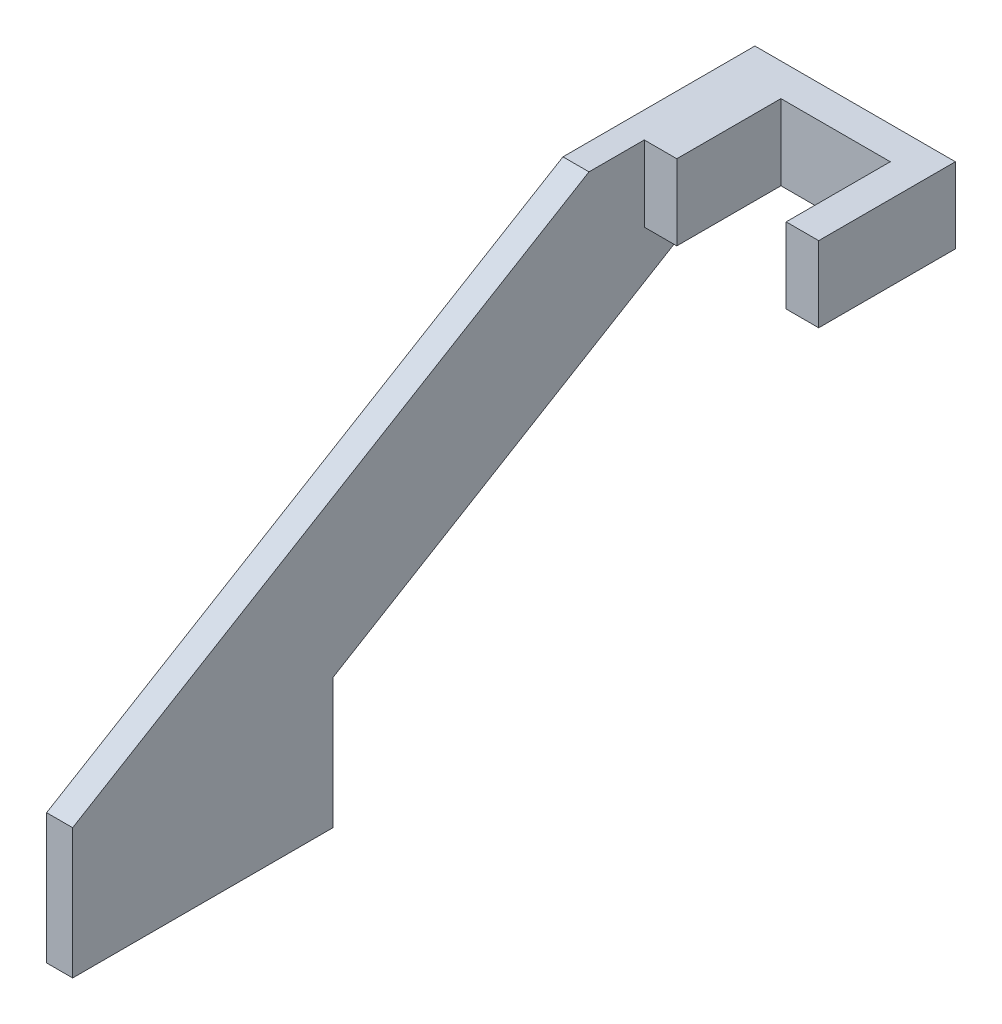
ISO-10303-21;
HEADER;
FILE_DESCRIPTION(('STEP AP214'),'2;1');
FILE_NAME('part.step','',(''),(''),'','','');
FILE_SCHEMA(('AUTOMOTIVE_DESIGN { 1 0 10303 214 1 1 1 1 }'));
ENDSEC;
DATA;
#1=APPLICATION_CONTEXT('core data for automotive mechanical design processes');
#2=APPLICATION_PROTOCOL_DEFINITION('international standard','automotive_design',2000,#1);
#3=PRODUCT_CONTEXT('',#1,'mechanical');
#4=PRODUCT('Part','Part','',(#3));
#5=PRODUCT_RELATED_PRODUCT_CATEGORY('part','',(#4));
#6=PRODUCT_DEFINITION_FORMATION('','',#4);
#7=PRODUCT_DEFINITION_CONTEXT('part definition',#1,'design');
#8=PRODUCT_DEFINITION('design','',#6,#7);
#9=PRODUCT_DEFINITION_SHAPE('','',#8);
#10=(LENGTH_UNIT() NAMED_UNIT(*) SI_UNIT(.MILLI.,.METRE.));
#11=(NAMED_UNIT(*) PLANE_ANGLE_UNIT() SI_UNIT($,.RADIAN.));
#12=(NAMED_UNIT(*) SI_UNIT($,.STERADIAN.) SOLID_ANGLE_UNIT());
#13=UNCERTAINTY_MEASURE_WITH_UNIT(LENGTH_MEASURE(1.E-05),#10,'distance_accuracy_value','');
#14=(GEOMETRIC_REPRESENTATION_CONTEXT(3) GLOBAL_UNCERTAINTY_ASSIGNED_CONTEXT((#13)) GLOBAL_UNIT_ASSIGNED_CONTEXT((#10,
#11,#12)) REPRESENTATION_CONTEXT('',''));
#15=CARTESIAN_POINT('',(0.,0.,0.));
#16=DIRECTION('',(0.,0.,1.));
#17=DIRECTION('',(1.,0.,0.));
#18=AXIS2_PLACEMENT_3D('',#15,#16,#17);
#19=CARTESIAN_POINT('',(2.54,0.,0.));
#20=DIRECTION('',(1.,0.,0.));
#21=DIRECTION('',(0.,0.,-1.));
#22=AXIS2_PLACEMENT_3D('',#19,#20,#21);
#23=PLANE('',#22);
#24=DIRECTION('',(0.,0.514495755427526,-0.857492925712544));
#25=VECTOR('',#24,1.);
#26=CARTESIAN_POINT('',(2.54,-17.237142577649,21.989657734469));
#27=LINE('',#26,#25);
#28=CARTESIAN_POINT('',(2.54,-17.237142577649,21.989657734469));
#29=VERTEX_POINT('',#28);
#30=CARTESIAN_POINT('',(2.54,5.62285742235095,-16.1103422655311));
#31=VERTEX_POINT('',#30);
#32=EDGE_CURVE('E229',#29,#31,#27,.T.);
#33=ORIENTED_EDGE('',*,*,#32,.T.);
#34=DIRECTION('',(0.,0.,1.));
#35=VECTOR('',#34,1.);
#36=CARTESIAN_POINT('',(2.54,5.62285742235095,0.));
#37=LINE('',#36,#35);
#38=CARTESIAN_POINT('',(2.54,5.62285742235095,-8.37978701278809));
#39=VERTEX_POINT('',#38);
#40=EDGE_CURVE('E11',#31,#39,#37,.T.);
#41=ORIENTED_EDGE('',*,*,#40,.T.);
#42=DIRECTION('',(0.,1.,0.));
#43=VECTOR('',#42,1.);
#44=CARTESIAN_POINT('',(2.54,0.,-8.37978701278809));
#45=LINE('',#44,#43);
#46=CARTESIAN_POINT('',(2.54,12.9888574223509,-8.37978701278809));
#47=VERTEX_POINT('',#46);
#48=EDGE_CURVE('E201',#39,#47,#45,.T.);
#49=ORIENTED_EDGE('',*,*,#48,.T.);
#50=DIRECTION('',(0.,0.,1.));
#51=VECTOR('',#50,1.);
#52=CARTESIAN_POINT('',(2.54,12.9888574223509,-21.7147870127881));
#53=LINE('',#52,#51);
#54=CARTESIAN_POINT('',(2.54,12.9888574223509,-2.98700893219766));
#55=VERTEX_POINT('',#54);
#56=EDGE_CURVE('E234',#47,#55,#53,.T.);
#57=ORIENTED_EDGE('',*,*,#56,.T.);
#58=DIRECTION('',(0.,-0.514495755427527,0.857492925712544));
#59=VECTOR('',#58,1.);
#60=CARTESIAN_POINT('',(2.54,12.9888574223509,-2.98700893219766));
#61=LINE('',#60,#59);
#62=CARTESIAN_POINT('',(2.54,-17.237142577649,47.389657734469));
#63=VERTEX_POINT('',#62);
#64=EDGE_CURVE('E232',#55,#63,#61,.T.);
#65=ORIENTED_EDGE('',*,*,#64,.T.);
#66=DIRECTION('',(0.,-1.,0.));
#67=VECTOR('',#66,1.);
#68=CARTESIAN_POINT('',(2.54,-17.237142577649,47.389657734469));
#69=LINE('',#68,#67);
#70=CARTESIAN_POINT('',(2.54,-29.937142577649,47.389657734469));
#71=VERTEX_POINT('',#70);
#72=EDGE_CURVE('E221',#63,#71,#69,.T.);
#73=ORIENTED_EDGE('',*,*,#72,.T.);
#74=DIRECTION('',(0.,0.,-1.));
#75=VECTOR('',#74,1.);
#76=CARTESIAN_POINT('',(2.54,-29.937142577649,47.389657734469));
#77=LINE('',#76,#75);
#78=CARTESIAN_POINT('',(2.54,-29.937142577649,21.989657734469));
#79=VERTEX_POINT('',#78);
#80=EDGE_CURVE('E224',#71,#79,#77,.T.);
#81=ORIENTED_EDGE('',*,*,#80,.T.);
#82=DIRECTION('',(0.,1.,0.));
#83=VECTOR('',#82,1.);
#84=CARTESIAN_POINT('',(2.54,-29.937142577649,21.989657734469));
#85=LINE('',#84,#83);
#86=EDGE_CURVE('E227',#79,#29,#85,.T.);
#87=ORIENTED_EDGE('',*,*,#86,.T.);
#88=EDGE_LOOP('',(#33,#41,#49,#57,#65,#73,#81,#87));
#89=FACE_BOUND('',#88,.T.);
#90=ADVANCED_FACE('F35',(#89),#23,.T.);
#91=CARTESIAN_POINT('',(2.54,-17.237142577649,47.389657734469));
#92=DIRECTION('',(0.,0.,-1.));
#93=DIRECTION('',(-1.,0.,0.));
#94=AXIS2_PLACEMENT_3D('',#91,#92,#93);
#95=PLANE('',#94);
#96=DIRECTION('',(0.,-1.,0.));
#97=VECTOR('',#96,1.);
#98=CARTESIAN_POINT('',(0.,-17.237142577649,47.389657734469));
#99=LINE('',#98,#97);
#100=CARTESIAN_POINT('',(0.,-17.237142577649,47.389657734469));
#101=VERTEX_POINT('',#100);
#102=CARTESIAN_POINT('',(0.,-29.937142577649,47.389657734469));
#103=VERTEX_POINT('',#102);
#104=EDGE_CURVE('E262',#101,#103,#99,.T.);
#105=ORIENTED_EDGE('',*,*,#104,.T.);
#106=DIRECTION('',(-1.,0.,0.));
#107=VECTOR('',#106,1.);
#108=CARTESIAN_POINT('',(2.54,-29.937142577649,47.389657734469));
#109=LINE('',#108,#107);
#110=EDGE_CURVE('E45',#71,#103,#109,.T.);
#111=ORIENTED_EDGE('',*,*,#110,.F.);
#112=ORIENTED_EDGE('',*,*,#72,.F.);
#113=DIRECTION('',(-1.,0.,0.));
#114=VECTOR('',#113,1.);
#115=CARTESIAN_POINT('',(2.54,-17.237142577649,47.389657734469));
#116=LINE('',#115,#114);
#117=EDGE_CURVE('E248',#63,#101,#116,.T.);
#118=ORIENTED_EDGE('',*,*,#117,.T.);
#119=EDGE_LOOP('',(#105,#111,#112,#118));
#120=FACE_BOUND('',#119,.T.);
#121=ADVANCED_FACE('F37',(#120),#95,.F.);
#122=CARTESIAN_POINT('',(2.54,-29.937142577649,47.389657734469));
#123=DIRECTION('',(0.,1.,0.));
#124=DIRECTION('',(0.,0.,1.));
#125=AXIS2_PLACEMENT_3D('',#122,#123,#124);
#126=PLANE('',#125);
#127=DIRECTION('',(0.,0.,-1.));
#128=VECTOR('',#127,1.);
#129=CARTESIAN_POINT('',(0.,-29.937142577649,47.389657734469));
#130=LINE('',#129,#128);
#131=CARTESIAN_POINT('',(0.,-29.937142577649,21.989657734469));
#132=VERTEX_POINT('',#131);
#133=EDGE_CURVE('E261',#103,#132,#130,.T.);
#134=ORIENTED_EDGE('',*,*,#133,.T.);
#135=DIRECTION('',(-1.,0.,0.));
#136=VECTOR('',#135,1.);
#137=CARTESIAN_POINT('',(2.54,-29.937142577649,21.989657734469));
#138=LINE('',#137,#136);
#139=EDGE_CURVE('E238',#79,#132,#138,.T.);
#140=ORIENTED_EDGE('',*,*,#139,.F.);
#141=ORIENTED_EDGE('',*,*,#80,.F.);
#142=ORIENTED_EDGE('',*,*,#110,.T.);
#143=EDGE_LOOP('',(#134,#140,#141,#142));
#144=FACE_BOUND('',#143,.T.);
#145=ADVANCED_FACE('F276',(#144),#126,.F.);
#146=CARTESIAN_POINT('',(2.54,-29.937142577649,21.989657734469));
#147=DIRECTION('',(0.,0.,1.));
#148=DIRECTION('',(1.,0.,0.));
#149=AXIS2_PLACEMENT_3D('',#146,#147,#148);
#150=PLANE('',#149);
#151=DIRECTION('',(0.,1.,0.));
#152=VECTOR('',#151,1.);
#153=CARTESIAN_POINT('',(0.,-29.937142577649,21.989657734469));
#154=LINE('',#153,#152);
#155=CARTESIAN_POINT('',(0.,-17.237142577649,21.989657734469));
#156=VERTEX_POINT('',#155);
#157=EDGE_CURVE('E259',#132,#156,#154,.T.);
#158=ORIENTED_EDGE('',*,*,#157,.T.);
#159=DIRECTION('',(-1.,0.,0.));
#160=VECTOR('',#159,1.);
#161=CARTESIAN_POINT('',(2.54,-17.237142577649,21.989657734469));
#162=LINE('',#161,#160);
#163=EDGE_CURVE('E241',#29,#156,#162,.T.);
#164=ORIENTED_EDGE('',*,*,#163,.F.);
#165=ORIENTED_EDGE('',*,*,#86,.F.);
#166=ORIENTED_EDGE('',*,*,#139,.T.);
#167=EDGE_LOOP('',(#158,#164,#165,#166));
#168=FACE_BOUND('',#167,.T.);
#169=ADVANCED_FACE('F300',(#168),#150,.F.);
#170=CARTESIAN_POINT('',(2.54,-17.237142577649,21.989657734469));
#171=DIRECTION('',(0.,0.857492925712544,0.514495755427526));
#172=DIRECTION('',(0.,-0.514495755427526,0.857492925712544));
#173=AXIS2_PLACEMENT_3D('',#170,#171,#172);
#174=PLANE('',#173);
#175=DIRECTION('',(0.,0.514495755427526,-0.857492925712544));
#176=VECTOR('',#175,1.);
#177=CARTESIAN_POINT('',(0.,-17.237142577649,21.989657734469));
#178=LINE('',#177,#176);
#179=CARTESIAN_POINT('',(0.,5.62285742235095,-16.110342265531));
#180=VERTEX_POINT('',#179);
#181=EDGE_CURVE('E257',#156,#180,#178,.T.);
#182=ORIENTED_EDGE('',*,*,#181,.T.);
#183=DIRECTION('',(-1.,0.,0.));
#184=VECTOR('',#183,1.);
#185=CARTESIAN_POINT('',(2.54,5.62285742235095,-16.110342265531));
#186=LINE('',#185,#184);
#187=EDGE_CURVE('E244',#31,#180,#186,.T.);
#188=ORIENTED_EDGE('',*,*,#187,.F.);
#189=ORIENTED_EDGE('',*,*,#32,.F.);
#190=ORIENTED_EDGE('',*,*,#163,.T.);
#191=EDGE_LOOP('',(#182,#188,#189,#190));
#192=FACE_BOUND('',#191,.T.);
#193=ADVANCED_FACE('F298',(#192),#174,.F.);
#194=CARTESIAN_POINT('',(2.54,5.62285742235095,-16.110342265531));
#195=DIRECTION('',(0.,1.,0.));
#196=DIRECTION('',(0.,0.,1.));
#197=AXIS2_PLACEMENT_3D('',#194,#195,#196);
#198=PLANE('',#197);
#199=DIRECTION('',(0.,0.,-1.));
#200=VECTOR('',#199,1.);
#201=CARTESIAN_POINT('',(0.,5.62285742235095,-16.110342265531));
#202=LINE('',#201,#200);
#203=CARTESIAN_POINT('',(0.,5.62285742235095,-21.7147870127881));
#204=VERTEX_POINT('',#203);
#205=EDGE_CURVE('E255',#180,#204,#202,.T.);
#206=ORIENTED_EDGE('',*,*,#205,.T.);
#207=DIRECTION('',(-1.,0.,0.));
#208=VECTOR('',#207,1.);
#209=CARTESIAN_POINT('',(2.54,5.62285742235095,-21.7147870127881));
#210=LINE('',#209,#208);
#211=CARTESIAN_POINT('',(19.558,5.62285742235095,-21.7147870127881));
#212=VERTEX_POINT('',#211);
#213=EDGE_CURVE('E151',#212,#204,#210,.T.);
#214=ORIENTED_EDGE('',*,*,#213,.F.);
#215=DIRECTION('',(0.,0.,-1.));
#216=VECTOR('',#215,1.);
#217=CARTESIAN_POINT('',(19.558,5.62285742235095,-21.7147870127881));
#218=LINE('',#217,#216);
#219=CARTESIAN_POINT('',(19.558,5.62285742235095,-8.37978701278808));
#220=VERTEX_POINT('',#219);
#221=EDGE_CURVE('E166',#220,#212,#218,.T.);
#222=ORIENTED_EDGE('',*,*,#221,.F.);
#223=DIRECTION('',(-1.,0.,0.));
#224=VECTOR('',#223,1.);
#225=CARTESIAN_POINT('',(19.558,5.62285742235095,-8.37978701278808));
#226=LINE('',#225,#224);
#227=CARTESIAN_POINT('',(16.383,5.62285742235095,-8.37978701278808));
#228=VERTEX_POINT('',#227);
#229=EDGE_CURVE('E175',#220,#228,#226,.T.);
#230=ORIENTED_EDGE('',*,*,#229,.T.);
#231=DIRECTION('',(0.,0.,-1.));
#232=VECTOR('',#231,1.);
#233=CARTESIAN_POINT('',(16.383,5.62285742235095,-21.7147870127881));
#234=LINE('',#233,#232);
#235=CARTESIAN_POINT('',(16.383,5.62285742235095,-18.5397870127881));
#236=VERTEX_POINT('',#235);
#237=EDGE_CURVE('E167',#228,#236,#234,.T.);
#238=ORIENTED_EDGE('',*,*,#237,.T.);
#239=DIRECTION('',(-1.,0.,0.));
#240=VECTOR('',#239,1.);
#241=CARTESIAN_POINT('',(16.383,5.62285742235095,-18.5397870127881));
#242=LINE('',#241,#240);
#243=CARTESIAN_POINT('',(5.715,5.62285742235095,-18.5397870127881));
#244=VERTEX_POINT('',#243);
#245=EDGE_CURVE('E194',#236,#244,#242,.T.);
#246=ORIENTED_EDGE('',*,*,#245,.T.);
#247=DIRECTION('',(0.,0.,1.));
#248=VECTOR('',#247,1.);
#249=CARTESIAN_POINT('',(5.715,5.62285742235095,0.));
#250=LINE('',#249,#248);
#251=CARTESIAN_POINT('',(5.715,5.62285742235095,-8.37978701278809));
#252=VERTEX_POINT('',#251);
#253=EDGE_CURVE('E191',#244,#252,#250,.T.);
#254=ORIENTED_EDGE('',*,*,#253,.T.);
#255=DIRECTION('',(-1.,0.,0.));
#256=VECTOR('',#255,1.);
#257=CARTESIAN_POINT('',(5.715,5.62285742235095,-8.37978701278809));
#258=LINE('',#257,#256);
#259=EDGE_CURVE('E219',#252,#39,#258,.T.);
#260=ORIENTED_EDGE('',*,*,#259,.T.);
#261=ORIENTED_EDGE('',*,*,#40,.F.);
#262=ORIENTED_EDGE('',*,*,#187,.T.);
#263=EDGE_LOOP('',(#206,#214,#222,#230,#238,#246,#254,#260,#261,#262));
#264=FACE_BOUND('',#263,.T.);
#265=ADVANCED_FACE('F286',(#264),#198,.F.);
#266=CARTESIAN_POINT('',(2.54,5.62285742235095,-21.7147870127881));
#267=DIRECTION('',(0.,0.,1.));
#268=DIRECTION('',(1.,0.,0.));
#269=AXIS2_PLACEMENT_3D('',#266,#267,#268);
#270=PLANE('',#269);
#271=DIRECTION('',(0.,1.,0.));
#272=VECTOR('',#271,1.);
#273=CARTESIAN_POINT('',(0.,5.62285742235095,-21.7147870127881));
#274=LINE('',#273,#272);
#275=CARTESIAN_POINT('',(0.,12.9888574223509,-21.7147870127881));
#276=VERTEX_POINT('',#275);
#277=EDGE_CURVE('E148',#204,#276,#274,.T.);
#278=ORIENTED_EDGE('',*,*,#277,.T.);
#279=DIRECTION('',(-1.,0.,0.));
#280=VECTOR('',#279,1.);
#281=CARTESIAN_POINT('',(2.54,12.9888574223509,-21.7147870127881));
#282=LINE('',#281,#280);
#283=CARTESIAN_POINT('',(19.558,12.9888574223509,-21.7147870127881));
#284=VERTEX_POINT('',#283);
#285=EDGE_CURVE('E141',#284,#276,#282,.T.);
#286=ORIENTED_EDGE('',*,*,#285,.F.);
#287=DIRECTION('',(0.,1.,0.));
#288=VECTOR('',#287,1.);
#289=CARTESIAN_POINT('',(19.558,5.62285742235095,-21.7147870127881));
#290=LINE('',#289,#288);
#291=EDGE_CURVE('E146',#212,#284,#290,.T.);
#292=ORIENTED_EDGE('',*,*,#291,.F.);
#293=ORIENTED_EDGE('',*,*,#213,.T.);
#294=EDGE_LOOP('',(#278,#286,#292,#293));
#295=FACE_BOUND('',#294,.T.);
#296=ADVANCED_FACE('F143',(#295),#270,.F.);
#297=CARTESIAN_POINT('',(2.54,12.9888574223509,-21.7147870127881));
#298=DIRECTION('',(0.,-1.,0.));
#299=DIRECTION('',(0.,0.,-1.));
#300=AXIS2_PLACEMENT_3D('',#297,#298,#299);
#301=PLANE('',#300);
#302=DIRECTION('',(0.,0.,1.));
#303=VECTOR('',#302,1.);
#304=CARTESIAN_POINT('',(0.,12.9888574223509,-21.7147870127881));
#305=LINE('',#304,#303);
#306=CARTESIAN_POINT('',(0.,12.9888574223509,-2.98700893219766));
#307=VERTEX_POINT('',#306);
#308=EDGE_CURVE('E252',#276,#307,#305,.T.);
#309=ORIENTED_EDGE('',*,*,#308,.T.);
#310=DIRECTION('',(-1.,0.,0.));
#311=VECTOR('',#310,1.);
#312=CARTESIAN_POINT('',(2.54,12.9888574223509,-2.98700893219766));
#313=LINE('',#312,#311);
#314=EDGE_CURVE('E152',#55,#307,#313,.T.);
#315=ORIENTED_EDGE('',*,*,#314,.F.);
#316=ORIENTED_EDGE('',*,*,#56,.F.);
#317=DIRECTION('',(-1.,0.,0.));
#318=VECTOR('',#317,1.);
#319=CARTESIAN_POINT('',(5.715,12.9888574223509,-8.37978701278809));
#320=LINE('',#319,#318);
#321=CARTESIAN_POINT('',(5.715,12.9888574223509,-8.37978701278809));
#322=VERTEX_POINT('',#321);
#323=EDGE_CURVE('E61',#322,#47,#320,.T.);
#324=ORIENTED_EDGE('',*,*,#323,.F.);
#325=DIRECTION('',(0.,0.,1.));
#326=VECTOR('',#325,1.);
#327=CARTESIAN_POINT('',(5.715,12.9888574223509,0.));
#328=LINE('',#327,#326);
#329=CARTESIAN_POINT('',(5.715,12.9888574223509,-18.5397870127881));
#330=VERTEX_POINT('',#329);
#331=EDGE_CURVE('E205',#330,#322,#328,.T.);
#332=ORIENTED_EDGE('',*,*,#331,.F.);
#333=DIRECTION('',(-1.,0.,0.));
#334=VECTOR('',#333,1.);
#335=CARTESIAN_POINT('',(16.383,12.9888574223509,-18.5397870127881));
#336=LINE('',#335,#334);
#337=CARTESIAN_POINT('',(16.383,12.9888574223509,-18.5397870127881));
#338=VERTEX_POINT('',#337);
#339=EDGE_CURVE('E197',#338,#330,#336,.T.);
#340=ORIENTED_EDGE('',*,*,#339,.F.);
#341=DIRECTION('',(0.,0.,1.));
#342=VECTOR('',#341,1.);
#343=CARTESIAN_POINT('',(16.383,12.9888574223509,-21.7147870127881));
#344=LINE('',#343,#342);
#345=CARTESIAN_POINT('',(16.383,12.9888574223509,-8.37978701278808));
#346=VERTEX_POINT('',#345);
#347=EDGE_CURVE('E180',#338,#346,#344,.T.);
#348=ORIENTED_EDGE('',*,*,#347,.T.);
#349=DIRECTION('',(-1.,0.,0.));
#350=VECTOR('',#349,1.);
#351=CARTESIAN_POINT('',(19.558,12.9888574223509,-8.37978701278808));
#352=LINE('',#351,#350);
#353=CARTESIAN_POINT('',(19.558,12.9888574223509,-8.37978701278808));
#354=VERTEX_POINT('',#353);
#355=EDGE_CURVE('E158',#354,#346,#352,.T.);
#356=ORIENTED_EDGE('',*,*,#355,.F.);
#357=DIRECTION('',(0.,0.,1.));
#358=VECTOR('',#357,1.);
#359=CARTESIAN_POINT('',(19.558,12.9888574223509,-21.7147870127881));
#360=LINE('',#359,#358);
#361=EDGE_CURVE('E155',#284,#354,#360,.T.);
#362=ORIENTED_EDGE('',*,*,#361,.F.);
#363=ORIENTED_EDGE('',*,*,#285,.T.);
#364=EDGE_LOOP('',(#309,#315,#316,#324,#332,#340,#348,#356,#362,#363));
#365=FACE_BOUND('',#364,.T.);
#366=ADVANCED_FACE('F156',(#365),#301,.F.);
#367=CARTESIAN_POINT('',(2.54,12.9888574223509,-2.98700893219766));
#368=DIRECTION('',(0.,-0.857492925712544,-0.514495755427527));
#369=DIRECTION('',(0.,0.514495755427527,-0.857492925712544));
#370=AXIS2_PLACEMENT_3D('',#367,#368,#369);
#371=PLANE('',#370);
#372=DIRECTION('',(0.,-0.514495755427527,0.857492925712544));
#373=VECTOR('',#372,1.);
#374=CARTESIAN_POINT('',(0.,12.9888574223509,-2.98700893219766));
#375=LINE('',#374,#373);
#376=EDGE_CURVE('E225',#307,#101,#375,.T.);
#377=ORIENTED_EDGE('',*,*,#376,.T.);
#378=ORIENTED_EDGE('',*,*,#117,.F.);
#379=ORIENTED_EDGE('',*,*,#64,.F.);
#380=ORIENTED_EDGE('',*,*,#314,.T.);
#381=EDGE_LOOP('',(#377,#378,#379,#380));
#382=FACE_BOUND('',#381,.T.);
#383=ADVANCED_FACE('F282',(#382),#371,.F.);
#384=CARTESIAN_POINT('',(0.,0.,0.));
#385=DIRECTION('',(1.,0.,0.));
#386=DIRECTION('',(0.,0.,-1.));
#387=AXIS2_PLACEMENT_3D('',#384,#385,#386);
#388=PLANE('',#387);
#389=ORIENTED_EDGE('',*,*,#104,.F.);
#390=ORIENTED_EDGE('',*,*,#376,.F.);
#391=ORIENTED_EDGE('',*,*,#308,.F.);
#392=ORIENTED_EDGE('',*,*,#277,.F.);
#393=ORIENTED_EDGE('',*,*,#205,.F.);
#394=ORIENTED_EDGE('',*,*,#181,.F.);
#395=ORIENTED_EDGE('',*,*,#157,.F.);
#396=ORIENTED_EDGE('',*,*,#133,.F.);
#397=EDGE_LOOP('',(#389,#390,#391,#392,#393,#394,#395,#396));
#398=FACE_BOUND('',#397,.T.);
#399=ADVANCED_FACE('F271',(#398),#388,.F.);
#400=CARTESIAN_POINT('',(5.715,0.,-8.37978701278809));
#401=DIRECTION('',(0.,0.,1.));
#402=DIRECTION('',(1.,0.,0.));
#403=AXIS2_PLACEMENT_3D('',#400,#401,#402);
#404=PLANE('',#403);
#405=ORIENTED_EDGE('',*,*,#48,.F.);
#406=ORIENTED_EDGE('',*,*,#259,.F.);
#407=DIRECTION('',(0.,1.,0.));
#408=VECTOR('',#407,1.);
#409=CARTESIAN_POINT('',(5.715,0.,-8.37978701278809));
#410=LINE('',#409,#408);
#411=EDGE_CURVE('E209',#252,#322,#410,.T.);
#412=ORIENTED_EDGE('',*,*,#411,.T.);
#413=ORIENTED_EDGE('',*,*,#323,.T.);
#414=EDGE_LOOP('',(#405,#406,#412,#413));
#415=FACE_BOUND('',#414,.T.);
#416=ADVANCED_FACE('F315',(#415),#404,.T.);
#417=CARTESIAN_POINT('',(5.715,0.,0.));
#418=DIRECTION('',(1.,0.,0.));
#419=DIRECTION('',(0.,0.,-1.));
#420=AXIS2_PLACEMENT_3D('',#417,#418,#419);
#421=PLANE('',#420);
#422=DIRECTION('',(0.,-1.,0.));
#423=VECTOR('',#422,1.);
#424=CARTESIAN_POINT('',(5.715,5.62285742235095,-18.5397870127881));
#425=LINE('',#424,#423);
#426=EDGE_CURVE('E53',#330,#244,#425,.T.);
#427=ORIENTED_EDGE('',*,*,#426,.F.);
#428=ORIENTED_EDGE('',*,*,#331,.T.);
#429=ORIENTED_EDGE('',*,*,#411,.F.);
#430=ORIENTED_EDGE('',*,*,#253,.F.);
#431=EDGE_LOOP('',(#427,#428,#429,#430));
#432=FACE_BOUND('',#431,.T.);
#433=ADVANCED_FACE('F354',(#432),#421,.T.);
#434=CARTESIAN_POINT('',(16.383,5.62285742235095,-18.5397870127881));
#435=DIRECTION('',(0.,0.,-1.));
#436=DIRECTION('',(-1.,0.,0.));
#437=AXIS2_PLACEMENT_3D('',#434,#435,#436);
#438=PLANE('',#437);
#439=ORIENTED_EDGE('',*,*,#426,.T.);
#440=ORIENTED_EDGE('',*,*,#245,.F.);
#441=DIRECTION('',(0.,-1.,0.));
#442=VECTOR('',#441,1.);
#443=CARTESIAN_POINT('',(16.383,5.62285742235095,-18.5397870127881));
#444=LINE('',#443,#442);
#445=EDGE_CURVE('E39',#338,#236,#444,.T.);
#446=ORIENTED_EDGE('',*,*,#445,.F.);
#447=ORIENTED_EDGE('',*,*,#339,.T.);
#448=EDGE_LOOP('',(#439,#440,#446,#447));
#449=FACE_BOUND('',#448,.T.);
#450=ADVANCED_FACE('F359',(#449),#438,.F.);
#451=CARTESIAN_POINT('',(16.383,0.,0.));
#452=DIRECTION('',(1.,0.,0.));
#453=DIRECTION('',(0.,0.,-1.));
#454=AXIS2_PLACEMENT_3D('',#451,#452,#453);
#455=PLANE('',#454);
#456=ORIENTED_EDGE('',*,*,#347,.F.);
#457=ORIENTED_EDGE('',*,*,#445,.T.);
#458=ORIENTED_EDGE('',*,*,#237,.F.);
#459=DIRECTION('',(0.,-1.,0.));
#460=VECTOR('',#459,1.);
#461=CARTESIAN_POINT('',(16.383,5.62285742235095,-8.37978701278808));
#462=LINE('',#461,#460);
#463=EDGE_CURVE('E170',#346,#228,#462,.T.);
#464=ORIENTED_EDGE('',*,*,#463,.F.);
#465=EDGE_LOOP('',(#456,#457,#458,#464));
#466=FACE_BOUND('',#465,.T.);
#467=ADVANCED_FACE('F364',(#466),#455,.F.);
#468=CARTESIAN_POINT('',(19.558,5.62285742235095,-8.37978701278808));
#469=DIRECTION('',(0.,0.,-1.));
#470=DIRECTION('',(-1.,0.,0.));
#471=AXIS2_PLACEMENT_3D('',#468,#469,#470);
#472=PLANE('',#471);
#473=ORIENTED_EDGE('',*,*,#463,.T.);
#474=ORIENTED_EDGE('',*,*,#229,.F.);
#475=DIRECTION('',(0.,-1.,0.));
#476=VECTOR('',#475,1.);
#477=CARTESIAN_POINT('',(19.558,5.62285742235095,-8.37978701278808));
#478=LINE('',#477,#476);
#479=EDGE_CURVE('E161',#354,#220,#478,.T.);
#480=ORIENTED_EDGE('',*,*,#479,.F.);
#481=ORIENTED_EDGE('',*,*,#355,.T.);
#482=EDGE_LOOP('',(#473,#474,#480,#481));
#483=FACE_BOUND('',#482,.T.);
#484=ADVANCED_FACE('F371',(#483),#472,.F.);
#485=CARTESIAN_POINT('',(19.558,0.,0.));
#486=DIRECTION('',(1.,0.,0.));
#487=DIRECTION('',(0.,0.,-1.));
#488=AXIS2_PLACEMENT_3D('',#485,#486,#487);
#489=PLANE('',#488);
#490=ORIENTED_EDGE('',*,*,#291,.T.);
#491=ORIENTED_EDGE('',*,*,#361,.T.);
#492=ORIENTED_EDGE('',*,*,#479,.T.);
#493=ORIENTED_EDGE('',*,*,#221,.T.);
#494=EDGE_LOOP('',(#490,#491,#492,#493));
#495=FACE_BOUND('',#494,.T.);
#496=ADVANCED_FACE('F164',(#495),#489,.T.);
#497=CLOSED_SHELL('',(#90,#121,#145,#169,#193,#265,#296,#366,#383,#399,#416,#433,#450,#467,#484,#496));
#498=MANIFOLD_SOLID_BREP('B2',#497);
#499=ADVANCED_BREP_SHAPE_REPRESENTATION('',(#18,#498),#14);
#500=SHAPE_DEFINITION_REPRESENTATION(#9,#499);
ENDSEC;
END-ISO-10303-21;
